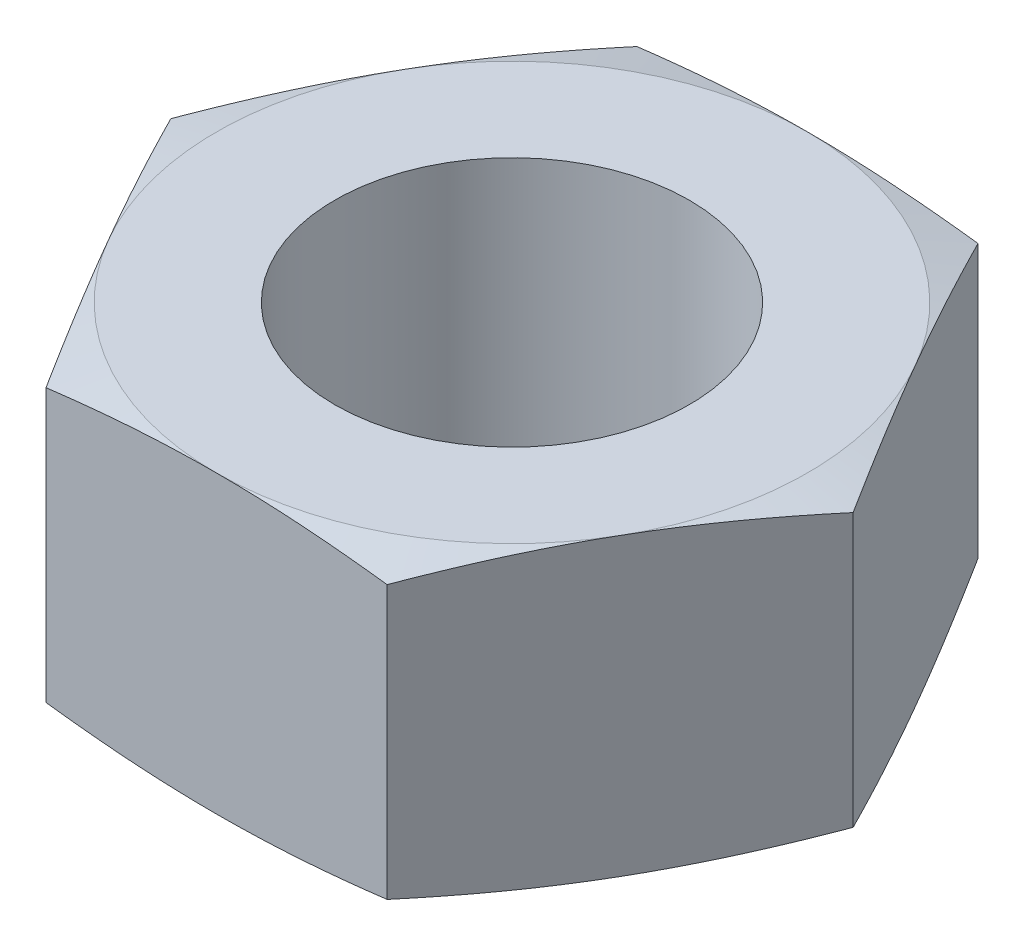
ISO-10303-21;
HEADER;
FILE_DESCRIPTION(('STEP AP214'),'2;1');
FILE_NAME('part.step','',(''),(''),'','','');
FILE_SCHEMA(('AUTOMOTIVE_DESIGN { 1 0 10303 214 1 1 1 1 }'));
ENDSEC;
DATA;
#1=APPLICATION_CONTEXT('core data for automotive mechanical design processes');
#2=APPLICATION_PROTOCOL_DEFINITION('international standard','automotive_design',2000,#1);
#3=PRODUCT_CONTEXT('',#1,'mechanical');
#4=PRODUCT('Part','Part','',(#3));
#5=PRODUCT_RELATED_PRODUCT_CATEGORY('part','',(#4));
#6=PRODUCT_DEFINITION_FORMATION('','',#4);
#7=PRODUCT_DEFINITION_CONTEXT('part definition',#1,'design');
#8=PRODUCT_DEFINITION('design','',#6,#7);
#9=PRODUCT_DEFINITION_SHAPE('','',#8);
#10=(LENGTH_UNIT() NAMED_UNIT(*) SI_UNIT(.MILLI.,.METRE.));
#11=(NAMED_UNIT(*) PLANE_ANGLE_UNIT() SI_UNIT($,.RADIAN.));
#12=(NAMED_UNIT(*) SI_UNIT($,.STERADIAN.) SOLID_ANGLE_UNIT());
#13=UNCERTAINTY_MEASURE_WITH_UNIT(LENGTH_MEASURE(1.E-05),#10,'distance_accuracy_value','');
#14=(GEOMETRIC_REPRESENTATION_CONTEXT(3) GLOBAL_UNCERTAINTY_ASSIGNED_CONTEXT((#13)) GLOBAL_UNIT_ASSIGNED_CONTEXT((#10,
#11,#12)) REPRESENTATION_CONTEXT('',''));
#15=CARTESIAN_POINT('',(0.,0.,0.));
#16=DIRECTION('',(0.,0.,1.));
#17=DIRECTION('',(1.,0.,0.));
#18=AXIS2_PLACEMENT_3D('',#15,#16,#17);
#19=CARTESIAN_POINT('',(2.88675134594813,5.,5.));
#20=DIRECTION('',(-0.866025403784439,0.,-0.5));
#21=DIRECTION('',(-0.5,0.,0.866025403784439));
#22=AXIS2_PLACEMENT_3D('',#19,#20,#21);
#23=PLANE('',#22);
#24=CARTESIAN_POINT('',(5.77361816195009,0.192884672145907,-0.000199999999995722));
#25=CARTESIAN_POINT('',(5.65367566346576,0.162966330406988,0.207546501361623));
#26=CARTESIAN_POINT('',(5.53354443530946,0.135814192823527,0.415619892103971));
#27=CARTESIAN_POINT('',(5.29291450358227,0.0881209127242306,0.8324031596773));
#28=CARTESIAN_POINT('',(5.17241568646937,0.0675820790041747,1.0411132331688));
#29=CARTESIAN_POINT('',(4.93168398048246,0.0342910124312709,1.45807277893085));
#30=CARTESIAN_POINT('',(4.81145231360634,0.0215043555509027,1.66632013463899));
#31=CARTESIAN_POINT('',(4.57085608718707,0.00435954963732404,2.08304502290651));
#32=CARTESIAN_POINT('',(4.45049155305463,0.,2.29152251145326));
#33=CARTESIAN_POINT('',(4.20976248478975,0.,2.70847748854675));
#34=CARTESIAN_POINT('',(4.08939795065731,0.00435954963732432,2.9169549770935));
#35=CARTESIAN_POINT('',(3.84880172423804,0.0215043555509033,3.33367986536102));
#36=CARTESIAN_POINT('',(3.72857005736192,0.0342910124312718,3.54192722106915));
#37=CARTESIAN_POINT('',(3.48783835137501,0.067582079004176,3.95888676683121));
#38=CARTESIAN_POINT('',(3.36733953426211,0.088120912724232,4.16759684032271));
#39=CARTESIAN_POINT('',(3.12670960253492,0.135814192823529,4.58438010789604));
#40=CARTESIAN_POINT('',(3.00657837437862,0.16296633040699,4.79245349863838));
#41=CARTESIAN_POINT('',(2.88663587589429,0.192884672145909,5.0002));
#42=B_SPLINE_CURVE_WITH_KNOTS('',3,(#24,#25,#26,#27,#28,#29,#30,#31,#32,#33,#34,#35,#36,#37,#38,
#39,#40,#41),.UNSPECIFIED.,.F.,.F.,(4,2,2,2,2,2,2,2,4),(0.,0.725263037411742,1.45077900033439,
2.1730492057684,2.89519935795036,3.61734951013232,4.33961971556633,5.06513567848897,
5.79039871590072),.UNSPECIFIED.);
#43=CARTESIAN_POINT('',(5.77350269189625,0.192855881364315,0.));
#44=VERTEX_POINT('',#43);
#45=CARTESIAN_POINT('',(4.3301270189222,0.,2.5));
#46=VERTEX_POINT('',#45);
#47=EDGE_CURVE('E51',#44,#46,#42,.T.);
#48=ORIENTED_EDGE('',*,*,#47,.F.);
#49=DIRECTION('',(0.,-1.,0.));
#50=VECTOR('',#49,1.);
#51=CARTESIAN_POINT('',(5.77350269189625,5.,0.));
#52=LINE('',#51,#50);
#53=CARTESIAN_POINT('',(5.77350269189625,4.80714411863568,0.));
#54=VERTEX_POINT('',#53);
#55=EDGE_CURVE('E167',#54,#44,#52,.T.);
#56=ORIENTED_EDGE('',*,*,#55,.F.);
#57=CARTESIAN_POINT('',(2.88663587589429,4.80711532785409,5.0002));
#58=CARTESIAN_POINT('',(3.00657837437862,4.83703366959301,4.79245349863838));
#59=CARTESIAN_POINT('',(3.12670960253491,4.86418580717647,4.58438010789604));
#60=CARTESIAN_POINT('',(3.36733953426211,4.91187908727577,4.16759684032271));
#61=CARTESIAN_POINT('',(3.48783835137501,4.93241792099582,3.95888676683121));
#62=CARTESIAN_POINT('',(3.72857005736192,4.96570898756873,3.54192722106915));
#63=CARTESIAN_POINT('',(3.84880172423804,4.9784956444491,3.33367986536102));
#64=CARTESIAN_POINT('',(4.08939795065731,4.99564045036268,2.9169549770935));
#65=CARTESIAN_POINT('',(4.20976248478975,5.,2.70847748854675));
#66=CARTESIAN_POINT('',(4.45049155305463,5.,2.29152251145326));
#67=CARTESIAN_POINT('',(4.57085608718707,4.99564045036268,2.08304502290651));
#68=CARTESIAN_POINT('',(4.81145231360634,4.9784956444491,1.66632013463899));
#69=CARTESIAN_POINT('',(4.93168398048246,4.96570898756873,1.45807277893085));
#70=CARTESIAN_POINT('',(5.17241568646937,4.93241792099583,1.0411132331688));
#71=CARTESIAN_POINT('',(5.29291450358227,4.91187908727577,0.8324031596773));
#72=CARTESIAN_POINT('',(5.53354443530946,4.86418580717647,0.415619892103971));
#73=CARTESIAN_POINT('',(5.65367566346576,4.83703366959301,0.207546501361623));
#74=CARTESIAN_POINT('',(5.77361816195009,4.80711532785409,-0.000199999999994956));
#75=B_SPLINE_CURVE_WITH_KNOTS('',3,(#57,#58,#59,#60,#61,#62,#63,#64,#65,#66,#67,#68,#69,#70,#71,
#72,#73,#74),.UNSPECIFIED.,.F.,.F.,(4,2,2,2,2,2,2,2,4),(0.,0.725263037411742,1.45077900033439,
2.1730492057684,2.89519935795036,3.61734951013232,4.33961971556633,5.06513567848898,
5.79039871590072),.UNSPECIFIED.);
#76=CARTESIAN_POINT('',(4.33012701892219,5.,2.5));
#77=VERTEX_POINT('',#76);
#78=EDGE_CURVE('E221',#77,#54,#75,.T.);
#79=ORIENTED_EDGE('',*,*,#78,.F.);
#80=CARTESIAN_POINT('',(2.88675134594813,4.80714411863568,5.));
#81=VERTEX_POINT('',#80);
#82=EDGE_CURVE('E319',#81,#77,#75,.T.);
#83=ORIENTED_EDGE('',*,*,#82,.F.);
#84=DIRECTION('',(0.,-1.,0.));
#85=VECTOR('',#84,1.);
#86=CARTESIAN_POINT('',(2.88675134594813,5.,5.));
#87=LINE('',#86,#85);
#88=CARTESIAN_POINT('',(2.88675134594813,0.192855881364317,5.));
#89=VERTEX_POINT('',#88);
#90=EDGE_CURVE('E153',#81,#89,#87,.T.);
#91=ORIENTED_EDGE('',*,*,#90,.T.);
#92=EDGE_CURVE('E146',#46,#89,#42,.T.);
#93=ORIENTED_EDGE('',*,*,#92,.F.);
#94=EDGE_LOOP('',(#48,#56,#79,#83,#91,#93));
#95=FACE_BOUND('',#94,.T.);
#96=ADVANCED_FACE('F35',(#95),#23,.F.);
#97=CARTESIAN_POINT('',(5.77350269189625,5.,0.));
#98=DIRECTION('',(-0.866025403784439,0.,0.5));
#99=DIRECTION('',(0.5,0.,0.866025403784439));
#100=AXIS2_PLACEMENT_3D('',#97,#98,#99);
#101=PLANE('',#100);
#102=CARTESIAN_POINT('',(2.88663587589428,0.192884672145907,-5.0002));
#103=CARTESIAN_POINT('',(3.00657837437862,0.162966330406988,-4.79245349863838));
#104=CARTESIAN_POINT('',(3.12670960253491,0.135814192823527,-4.58438010789603));
#105=CARTESIAN_POINT('',(3.3673395342621,0.0881209127242301,-4.1675968403227));
#106=CARTESIAN_POINT('',(3.48783835137501,0.067582079004174,-3.9588867668312));
#107=CARTESIAN_POINT('',(3.72857005736191,0.0342910124312699,-3.54192722106915));
#108=CARTESIAN_POINT('',(3.84880172423803,0.0215043555509016,-3.33367986536101));
#109=CARTESIAN_POINT('',(4.0893979506573,0.00435954963732282,-2.91695497709349));
#110=CARTESIAN_POINT('',(4.20976248478975,0.,-2.70847748854674));
#111=CARTESIAN_POINT('',(4.45049155305463,0.,-2.29152251145325));
#112=CARTESIAN_POINT('',(4.57085608718707,0.0043595496373228,-2.08304502290651));
#113=CARTESIAN_POINT('',(4.81145231360634,0.0215043555509016,-1.66632013463898));
#114=CARTESIAN_POINT('',(4.93168398048246,0.0342910124312699,-1.45807277893085));
#115=CARTESIAN_POINT('',(5.17241568646937,0.067582079004174,-1.04111323316879));
#116=CARTESIAN_POINT('',(5.29291450358227,0.0881209127242301,-0.832403159677293));
#117=CARTESIAN_POINT('',(5.53354443530946,0.135814192823527,-0.415619892103963));
#118=CARTESIAN_POINT('',(5.65367566346576,0.162966330406988,-0.207546501361615));
#119=CARTESIAN_POINT('',(5.77361816195009,0.192884672145907,0.000200000000003531));
#120=B_SPLINE_CURVE_WITH_KNOTS('',3,(#102,#103,#104,#105,#106,#107,#108,#109,#110,#111,#112,
#113,#114,#115,#116,#117,#118,#119),.UNSPECIFIED.,.F.,.F.,(4,2,2,2,2,2,2,2,4),(0.,
0.725263037411743,1.45077900033439,2.1730492057684,2.89519935795036,3.61734951013232,
4.33961971556633,5.06513567848898,5.79039871590072),.UNSPECIFIED.);
#121=CARTESIAN_POINT('',(2.88675134594812,0.192855881364315,-5.));
#122=VERTEX_POINT('',#121);
#123=CARTESIAN_POINT('',(4.33012701892219,0.,-2.5));
#124=VERTEX_POINT('',#123);
#125=EDGE_CURVE('E58',#122,#124,#120,.T.);
#126=ORIENTED_EDGE('',*,*,#125,.F.);
#127=DIRECTION('',(0.,-1.,0.));
#128=VECTOR('',#127,1.);
#129=CARTESIAN_POINT('',(2.88675134594812,5.,-5.));
#130=LINE('',#129,#128);
#131=CARTESIAN_POINT('',(2.88675134594812,4.80714411863568,-5.));
#132=VERTEX_POINT('',#131);
#133=EDGE_CURVE('E164',#132,#122,#130,.T.);
#134=ORIENTED_EDGE('',*,*,#133,.F.);
#135=CARTESIAN_POINT('',(5.77361816195009,4.80711532785409,0.000200000000004353));
#136=CARTESIAN_POINT('',(5.65367566346576,4.83703366959301,-0.207546501361615));
#137=CARTESIAN_POINT('',(5.53354443530946,4.86418580717647,-0.415619892103962));
#138=CARTESIAN_POINT('',(5.29291450358227,4.91187908727577,-0.832403159677292));
#139=CARTESIAN_POINT('',(5.17241568646937,4.93241792099583,-1.04111323316879));
#140=CARTESIAN_POINT('',(4.93168398048246,4.96570898756873,-1.45807277893085));
#141=CARTESIAN_POINT('',(4.81145231360634,4.9784956444491,-1.66632013463898));
#142=CARTESIAN_POINT('',(4.57085608718707,4.99564045036268,-2.0830450229065));
#143=CARTESIAN_POINT('',(4.45049155305463,5.,-2.29152251145325));
#144=CARTESIAN_POINT('',(4.20976248478975,5.,-2.70847748854674));
#145=CARTESIAN_POINT('',(4.0893979506573,4.99564045036268,-2.91695497709349));
#146=CARTESIAN_POINT('',(3.84880172423803,4.9784956444491,-3.33367986536101));
#147=CARTESIAN_POINT('',(3.72857005736191,4.96570898756873,-3.54192722106915));
#148=CARTESIAN_POINT('',(3.48783835137501,4.93241792099583,-3.9588867668312));
#149=CARTESIAN_POINT('',(3.3673395342621,4.91187908727577,-4.1675968403227));
#150=CARTESIAN_POINT('',(3.12670960253491,4.86418580717647,-4.58438010789603));
#151=CARTESIAN_POINT('',(3.00657837437862,4.83703366959301,-4.79245349863838));
#152=CARTESIAN_POINT('',(2.88663587589428,4.80711532785409,-5.0002));
#153=B_SPLINE_CURVE_WITH_KNOTS('',3,(#135,#136,#137,#138,#139,#140,#141,#142,#143,#144,#145,
#146,#147,#148,#149,#150,#151,#152),.UNSPECIFIED.,.F.,.F.,(4,2,2,2,2,2,2,2,4),(0.,
0.725263037411743,1.45077900033439,2.1730492057684,2.89519935795036,3.61734951013233,
4.33961971556633,5.06513567848898,5.79039871590072),.UNSPECIFIED.);
#154=CARTESIAN_POINT('',(4.33012701892219,5.,-2.5));
#155=VERTEX_POINT('',#154);
#156=EDGE_CURVE('E215',#155,#132,#153,.T.);
#157=ORIENTED_EDGE('',*,*,#156,.F.);
#158=EDGE_CURVE('E219',#54,#155,#153,.T.);
#159=ORIENTED_EDGE('',*,*,#158,.F.);
#160=ORIENTED_EDGE('',*,*,#55,.T.);
#161=EDGE_CURVE('E234',#124,#44,#120,.T.);
#162=ORIENTED_EDGE('',*,*,#161,.F.);
#163=EDGE_LOOP('',(#126,#134,#157,#159,#160,#162));
#164=FACE_BOUND('',#163,.T.);
#165=ADVANCED_FACE('F226',(#164),#101,.F.);
#166=CARTESIAN_POINT('',(2.88675134594812,5.,-5.));
#167=DIRECTION('',(0.,0.,1.));
#168=DIRECTION('',(1.,0.,0.));
#169=AXIS2_PLACEMENT_3D('',#166,#167,#168);
#170=PLANE('',#169);
#171=CARTESIAN_POINT('',(-7.6305218451275,1.02792106951907,-5.));
#172=CARTESIAN_POINT('',(-7.40369596858197,0.980630391697127,-5.));
#173=CARTESIAN_POINT('',(-7.17674631792952,0.933923199202165,-5.));
#174=CARTESIAN_POINT('',(-6.72253882576785,0.841989190230502,-5.));
#175=CARTESIAN_POINT('',(-6.49528097296649,0.796762429609511,-5.));
#176=CARTESIAN_POINT('',(-6.04021985114472,0.708068554088652,-5.));
#177=CARTESIAN_POINT('',(-5.81241628246833,0.66460297041051,-5.));
#178=CARTESIAN_POINT('',(-5.35639701616018,0.579895455230126,-5.));
#179=CARTESIAN_POINT('',(-5.12818132158576,0.538653507301369,-5.));
#180=CARTESIAN_POINT('',(-4.67283413751471,0.459191873470008,-5.));
#181=CARTESIAN_POINT('',(-4.44570596421195,0.420953378771854,-5.));
#182=CARTESIAN_POINT('',(-3.99091085303777,0.347835521530994,-5.));
#183=CARTESIAN_POINT('',(-3.76324390445121,0.312956226381003,-5.));
#184=CARTESIAN_POINT('',(-3.07937962246211,0.214509697113264,-5.));
#185=CARTESIAN_POINT('',(-2.6222327521849,0.157118226750703,-5.));
#186=CARTESIAN_POINT('',(-1.93248668202519,0.0888272191369867,-5.));
#187=CARTESIAN_POINT('',(-1.70077069534079,0.0689775119585176,-5.));
#188=CARTESIAN_POINT('',(-1.23683260927792,0.036375613089383,-5.));
#189=CARTESIAN_POINT('',(-1.0046105197085,0.0236232850475451,-5.));
#190=CARTESIAN_POINT('',(-0.5399532660013,0.00594222678315789,-5.));
#191=CARTESIAN_POINT('',(-0.307518218675345,0.00101047925139975,-5.));
#192=CARTESIAN_POINT('',(0.157382933946641,-0.000729494899017344,-5.));
#193=CARTESIAN_POINT('',(0.389849039217068,0.00246227182632879,-5.));
#194=CARTESIAN_POINT('',(0.855262774585651,0.0167900915629019,-5.));
#195=CARTESIAN_POINT('',(1.08820962128495,0.0279510853880331,-5.));
#196=CARTESIAN_POINT('',(1.5536330729725,0.0575887145548008,-5.));
#197=CARTESIAN_POINT('',(1.7861096692289,0.076065484508654,-5.));
#198=CARTESIAN_POINT('',(2.25058697366131,0.119410717922282,-5.));
#199=CARTESIAN_POINT('',(2.48258734776666,0.144282708696195,-5.));
#200=CARTESIAN_POINT('',(2.94594079229084,0.199401212899263,-5.));
#201=CARTESIAN_POINT('',(3.17729386083051,0.229647741914404,-5.));
#202=CARTESIAN_POINT('',(3.84072667935434,0.32279955205869,-5.));
#203=CARTESIAN_POINT('',(4.27203190491143,0.391195085335354,-5.));
#204=CARTESIAN_POINT('',(5.1328886807327,0.538250192622818,-5.));
#205=CARTESIAN_POINT('',(5.56244002934685,0.616910914396046,-5.));
#206=CARTESIAN_POINT('',(6.42031400903308,0.781134662562965,-5.));
#207=CARTESIAN_POINT('',(6.84863633330645,0.866699279401662,-5.));
#208=CARTESIAN_POINT('',(7.7042840186875,1.0425312050005,-5.));
#209=CARTESIAN_POINT('',(8.13160942985231,1.13279827208894,-5.));
#210=CARTESIAN_POINT('',(8.98191543182807,1.31585636607849,-5.));
#211=CARTESIAN_POINT('',(9.40490207057782,1.40861940533503,-5.));
#212=CARTESIAN_POINT('',(10.2503578957856,1.59649955627264,-5.));
#213=CARTESIAN_POINT('',(10.6728270738327,1.69161670569893,-5.));
#214=CARTESIAN_POINT('',(11.5169016313527,1.88348287421526,-5.));
#215=CARTESIAN_POINT('',(11.9385074492698,1.98022996855996,-5.));
#216=CARTESIAN_POINT('',(12.7813971606523,2.17506177463464,-5.));
#217=CARTESIAN_POINT('',(13.2026810631537,2.273146447245,-5.));
#218=CARTESIAN_POINT('',(13.623852884615,2.3717043755312,-5.));
#219=B_SPLINE_CURVE_WITH_KNOTS('',3,(#171,#172,#173,#174,#175,#176,#177,#178,#179,#180,#181,
#182,#183,#184,#185,#186,#187,#188,#189,#190,#191,#192,#193,#194,#195,#196,#197,#198,#199,#200,
#201,#202,#203,#204,#205,#206,#207,#208,#209,#210,#211,#212,#213,#214,#215,#216,#217,#218),
.UNSPECIFIED.,.F.,.F.,(4,2,2,2,2,2,2,2,2,2,2,2,2,2,2,2,2,2,2,2,2,2,2,4),(0.,0.695111991871213,
1.39025017969673,2.08598031236921,2.78170530481713,3.47265283456902,4.16361422331709,
5.54527459345935,6.24288042112804,6.94047284629219,7.63779606323015,8.33511870881707,
9.03463334323472,9.73416084950494,10.4340750142032,11.1339912086626,12.4438578844103,
13.7538711435296,15.0641870557896,16.3744356936585,17.6735432827575,18.9726717149382,
20.2703608102221,21.5680120335567),.UNSPECIFIED.);
#220=CARTESIAN_POINT('',(-2.88675134594813,0.192855881364317,-5.));
#221=VERTEX_POINT('',#220);
#222=CARTESIAN_POINT('',(0.,0.,-5.));
#223=VERTEX_POINT('',#222);
#224=EDGE_CURVE('E249',#221,#223,#219,.T.);
#225=ORIENTED_EDGE('',*,*,#224,.F.);
#226=DIRECTION('',(0.,-1.,0.));
#227=VECTOR('',#226,1.);
#228=CARTESIAN_POINT('',(-2.88675134594813,5.,-5.));
#229=LINE('',#228,#227);
#230=CARTESIAN_POINT('',(-2.88675134594813,4.80714411863568,-5.));
#231=VERTEX_POINT('',#230);
#232=EDGE_CURVE('E155',#231,#221,#229,.T.);
#233=ORIENTED_EDGE('',*,*,#232,.F.);
#234=CARTESIAN_POINT('',(-7.6305218451275,3.97207893048093,-5.));
#235=CARTESIAN_POINT('',(-7.40369596858198,4.01936960830287,-5.));
#236=CARTESIAN_POINT('',(-7.17674631792953,4.06607680079783,-5.));
#237=CARTESIAN_POINT('',(-6.72253882576786,4.1580108097695,-5.));
#238=CARTESIAN_POINT('',(-6.49528097296649,4.20323757039049,-5.));
#239=CARTESIAN_POINT('',(-6.04021985114473,4.29193144591135,-5.));
#240=CARTESIAN_POINT('',(-5.81241628246834,4.33539702958949,-5.));
#241=CARTESIAN_POINT('',(-5.35639701616018,4.42010454476987,-5.));
#242=CARTESIAN_POINT('',(-5.12818132158576,4.46134649269863,-5.));
#243=CARTESIAN_POINT('',(-4.67283413751471,4.54080812652999,-5.));
#244=CARTESIAN_POINT('',(-4.44570596421196,4.57904662122815,-5.));
#245=CARTESIAN_POINT('',(-3.99091085303778,4.652164478469,-5.));
#246=CARTESIAN_POINT('',(-3.76324390445121,4.687043773619,-5.));
#247=CARTESIAN_POINT('',(-3.07937962246211,4.78549030288674,-5.));
#248=CARTESIAN_POINT('',(-2.6222327521849,4.8428817732493,-5.));
#249=CARTESIAN_POINT('',(-1.93248668202519,4.91117278086301,-5.));
#250=CARTESIAN_POINT('',(-1.70077069534079,4.93102248804148,-5.));
#251=CARTESIAN_POINT('',(-1.23683260927792,4.96362438691062,-5.));
#252=CARTESIAN_POINT('',(-1.0046105197085,4.97637671495245,-5.));
#253=CARTESIAN_POINT('',(-0.539953266001301,4.99405777321684,-5.));
#254=CARTESIAN_POINT('',(-0.307518218675345,4.9989895207486,-5.));
#255=CARTESIAN_POINT('',(0.157382933946642,5.00072949489902,-5.));
#256=CARTESIAN_POINT('',(0.389849039217068,4.99753772817367,-5.));
#257=CARTESIAN_POINT('',(0.855262774585651,4.9832099084371,-5.));
#258=CARTESIAN_POINT('',(1.08820962128495,4.97204891461197,-5.));
#259=CARTESIAN_POINT('',(1.5536330729725,4.9424112854452,-5.));
#260=CARTESIAN_POINT('',(1.7861096692289,4.92393451549135,-5.));
#261=CARTESIAN_POINT('',(2.25058697366131,4.88058928207772,-5.));
#262=CARTESIAN_POINT('',(2.48258734776667,4.8557172913038,-5.));
#263=CARTESIAN_POINT('',(2.94594079229084,4.80059878710074,-5.));
#264=CARTESIAN_POINT('',(3.17729386083052,4.7703522580856,-5.));
#265=CARTESIAN_POINT('',(3.84072667935434,4.67720044794131,-5.));
#266=CARTESIAN_POINT('',(4.27203190491143,4.60880491466465,-5.));
#267=CARTESIAN_POINT('',(5.1328886807327,4.46174980737718,-5.));
#268=CARTESIAN_POINT('',(5.56244002934685,4.38308908560395,-5.));
#269=CARTESIAN_POINT('',(6.42031400903308,4.21886533743703,-5.));
#270=CARTESIAN_POINT('',(6.84863633330645,4.13330072059834,-5.));
#271=CARTESIAN_POINT('',(7.7042840186875,3.9574687949995,-5.));
#272=CARTESIAN_POINT('',(8.13160942985231,3.86720172791106,-5.));
#273=CARTESIAN_POINT('',(8.98191543182807,3.68414363392151,-5.));
#274=CARTESIAN_POINT('',(9.40490207057783,3.59138059466497,-5.));
#275=CARTESIAN_POINT('',(10.2503578957856,3.40350044372736,-5.));
#276=CARTESIAN_POINT('',(10.6728270738327,3.30838329430107,-5.));
#277=CARTESIAN_POINT('',(11.5169016313527,3.11651712578474,-5.));
#278=CARTESIAN_POINT('',(11.9385074492698,3.01977003144004,-5.));
#279=CARTESIAN_POINT('',(12.7813971606523,2.82493822536536,-5.));
#280=CARTESIAN_POINT('',(13.2026810631537,2.726853552755,-5.));
#281=CARTESIAN_POINT('',(13.623852884615,2.6282956244688,-5.));
#282=B_SPLINE_CURVE_WITH_KNOTS('',3,(#234,#235,#236,#237,#238,#239,#240,#241,#242,#243,#244,
#245,#246,#247,#248,#249,#250,#251,#252,#253,#254,#255,#256,#257,#258,#259,#260,#261,#262,#263,
#264,#265,#266,#267,#268,#269,#270,#271,#272,#273,#274,#275,#276,#277,#278,#279,#280,#281),
.UNSPECIFIED.,.F.,.F.,(4,2,2,2,2,2,2,2,2,2,2,2,2,2,2,2,2,2,2,2,2,2,2,4),(0.,0.695111991871213,
1.39025017969673,2.0859803123692,2.78170530481713,3.47265283456902,4.16361422331709,
5.54527459345935,6.24288042112804,6.94047284629219,7.63779606323015,8.33511870881707,
9.03463334323472,9.73416084950494,10.4340750142032,11.1339912086626,12.4438578844104,
13.7538711435296,15.0641870557896,16.3744356936585,17.6735432827576,18.9726717149382,
20.2703608102221,21.5680120335567),.UNSPECIFIED.);
#283=CARTESIAN_POINT('',(0.,5.,-5.));
#284=VERTEX_POINT('',#283);
#285=EDGE_CURVE('E209',#284,#231,#282,.F.);
#286=ORIENTED_EDGE('',*,*,#285,.F.);
#287=EDGE_CURVE('E220',#132,#284,#282,.F.);
#288=ORIENTED_EDGE('',*,*,#287,.F.);
#289=ORIENTED_EDGE('',*,*,#133,.T.);
#290=EDGE_CURVE('E245',#223,#122,#219,.T.);
#291=ORIENTED_EDGE('',*,*,#290,.F.);
#292=EDGE_LOOP('',(#225,#233,#286,#288,#289,#291));
#293=FACE_BOUND('',#292,.T.);
#294=ADVANCED_FACE('F229',(#293),#170,.F.);
#295=CARTESIAN_POINT('',(-2.88675134594813,5.,-5.));
#296=DIRECTION('',(0.866025403784439,0.,0.5));
#297=DIRECTION('',(0.5,0.,-0.866025403784439));
#298=AXIS2_PLACEMENT_3D('',#295,#296,#297);
#299=PLANE('',#298);
#300=CARTESIAN_POINT('',(-5.7736181619501,0.192884672145909,0.000200000000002456));
#301=CARTESIAN_POINT('',(-5.65367566346576,0.16296633040699,-0.207546501361616));
#302=CARTESIAN_POINT('',(-5.53354443530947,0.135814192823529,-0.415619892103964));
#303=CARTESIAN_POINT('',(-5.29291450358228,0.0881209127242324,-0.832403159677294));
#304=CARTESIAN_POINT('',(-5.17241568646938,0.0675820790041763,-1.04111323316879));
#305=CARTESIAN_POINT('',(-4.93168398048247,0.0342910124312723,-1.45807277893085));
#306=CARTESIAN_POINT('',(-4.81145231360635,0.021504355550904,-1.66632013463898));
#307=CARTESIAN_POINT('',(-4.57085608718708,0.00435954963732504,-2.0830450229065));
#308=CARTESIAN_POINT('',(-4.45049155305464,0.,-2.29152251145325));
#309=CARTESIAN_POINT('',(-4.20976248478976,0.,-2.70847748854674));
#310=CARTESIAN_POINT('',(-4.08939795065731,0.00435954963732486,-2.91695497709349));
#311=CARTESIAN_POINT('',(-3.84880172423804,0.0215043555509036,-3.33367986536101));
#312=CARTESIAN_POINT('',(-3.72857005736192,0.0342910124312718,-3.54192722106915));
#313=CARTESIAN_POINT('',(-3.48783835137502,0.0675820790041757,-3.9588867668312));
#314=CARTESIAN_POINT('',(-3.36733953426211,0.0881209127242317,-4.1675968403227));
#315=CARTESIAN_POINT('',(-3.12670960253492,0.135814192823528,-4.58438010789603));
#316=CARTESIAN_POINT('',(-3.00657837437863,0.162966330406989,-4.79245349863838));
#317=CARTESIAN_POINT('',(-2.88663587589429,0.192884672145909,-5.0002));
#318=B_SPLINE_CURVE_WITH_KNOTS('',3,(#300,#301,#302,#303,#304,#305,#306,#307,#308,#309,#310,
#311,#312,#313,#314,#315,#316,#317),.UNSPECIFIED.,.F.,.F.,(4,2,2,2,2,2,2,2,4),(0.,
0.725263037411742,1.45077900033439,2.1730492057684,2.89519935795036,3.61734951013232,
4.33961971556633,5.06513567848898,5.79039871590072),.UNSPECIFIED.);
#319=CARTESIAN_POINT('',(-5.77350269189626,0.192855881364317,0.));
#320=VERTEX_POINT('',#319);
#321=CARTESIAN_POINT('',(-4.33012701892219,0.,-2.5));
#322=VERTEX_POINT('',#321);
#323=EDGE_CURVE('E240',#320,#322,#318,.T.);
#324=ORIENTED_EDGE('',*,*,#323,.F.);
#325=DIRECTION('',(0.,-1.,0.));
#326=VECTOR('',#325,1.);
#327=CARTESIAN_POINT('',(-5.77350269189626,5.,0.));
#328=LINE('',#327,#326);
#329=CARTESIAN_POINT('',(-5.77350269189626,4.80714411863568,0.));
#330=VERTEX_POINT('',#329);
#331=EDGE_CURVE('E152',#330,#320,#328,.T.);
#332=ORIENTED_EDGE('',*,*,#331,.F.);
#333=CARTESIAN_POINT('',(-2.88663587589429,4.80711532785409,-5.0002));
#334=CARTESIAN_POINT('',(-3.00657837437863,4.83703366959301,-4.79245349863838));
#335=CARTESIAN_POINT('',(-3.12670960253492,4.86418580717647,-4.58438010789603));
#336=CARTESIAN_POINT('',(-3.36733953426211,4.91187908727577,-4.1675968403227));
#337=CARTESIAN_POINT('',(-3.48783835137502,4.93241792099582,-3.95888676683121));
#338=CARTESIAN_POINT('',(-3.72857005736192,4.96570898756873,-3.54192722106915));
#339=CARTESIAN_POINT('',(-3.84880172423804,4.9784956444491,-3.33367986536101));
#340=CARTESIAN_POINT('',(-4.08939795065731,4.99564045036268,-2.91695497709349));
#341=CARTESIAN_POINT('',(-4.20976248478975,5.,-2.70847748854675));
#342=CARTESIAN_POINT('',(-4.45049155305464,5.,-2.29152251145325));
#343=CARTESIAN_POINT('',(-4.57085608718708,4.99564045036268,-2.08304502290651));
#344=CARTESIAN_POINT('',(-4.81145231360635,4.9784956444491,-1.66632013463898));
#345=CARTESIAN_POINT('',(-4.93168398048247,4.96570898756873,-1.45807277893085));
#346=CARTESIAN_POINT('',(-5.17241568646938,4.93241792099582,-1.04111323316879));
#347=CARTESIAN_POINT('',(-5.29291450358228,4.91187908727577,-0.832403159677295));
#348=CARTESIAN_POINT('',(-5.53354443530947,4.86418580717647,-0.415619892103964));
#349=CARTESIAN_POINT('',(-5.65367566346576,4.83703366959301,-0.207546501361617));
#350=CARTESIAN_POINT('',(-5.7736181619501,4.80711532785409,0.000200000000001383));
#351=B_SPLINE_CURVE_WITH_KNOTS('',3,(#333,#334,#335,#336,#337,#338,#339,#340,#341,#342,#343,
#344,#345,#346,#347,#348,#349,#350),.UNSPECIFIED.,.F.,.F.,(4,2,2,2,2,2,2,2,4),(0.,
0.725263037411742,1.45077900033439,2.1730492057684,2.89519935795036,3.61734951013232,
4.33961971556633,5.06513567848898,5.79039871590072),.UNSPECIFIED.);
#352=CARTESIAN_POINT('',(-4.3301270189222,5.,-2.5));
#353=VERTEX_POINT('',#352);
#354=EDGE_CURVE('E203',#353,#330,#351,.T.);
#355=ORIENTED_EDGE('',*,*,#354,.F.);
#356=EDGE_CURVE('E439',#231,#353,#351,.T.);
#357=ORIENTED_EDGE('',*,*,#356,.F.);
#358=ORIENTED_EDGE('',*,*,#232,.T.);
#359=EDGE_CURVE('E250',#322,#221,#318,.T.);
#360=ORIENTED_EDGE('',*,*,#359,.F.);
#361=EDGE_LOOP('',(#324,#332,#355,#357,#358,#360));
#362=FACE_BOUND('',#361,.T.);
#363=ADVANCED_FACE('F301',(#362),#299,.F.);
#364=CARTESIAN_POINT('',(-5.77350269189626,5.,0.));
#365=DIRECTION('',(0.866025403784439,0.,-0.5));
#366=DIRECTION('',(-0.5,0.,-0.866025403784439));
#367=AXIS2_PLACEMENT_3D('',#364,#365,#366);
#368=PLANE('',#367);
#369=CARTESIAN_POINT('',(-2.88663587589429,0.192884672145909,5.0002));
#370=CARTESIAN_POINT('',(-3.00657837437863,0.16296633040699,4.79245349863838));
#371=CARTESIAN_POINT('',(-3.12670960253492,0.135814192823529,4.58438010789604));
#372=CARTESIAN_POINT('',(-3.36733953426211,0.0881209127242326,4.16759684032271));
#373=CARTESIAN_POINT('',(-3.48783835137502,0.0675820790041766,3.95888676683121));
#374=CARTESIAN_POINT('',(-3.72857005736192,0.0342910124312726,3.54192722106915));
#375=CARTESIAN_POINT('',(-3.84880172423804,0.0215043555509043,3.33367986536102));
#376=CARTESIAN_POINT('',(-4.08939795065731,0.00435954963732554,2.9169549770935));
#377=CARTESIAN_POINT('',(-4.20976248478976,0.,2.70847748854675));
#378=CARTESIAN_POINT('',(-4.45049155305464,0.,2.29152251145326));
#379=CARTESIAN_POINT('',(-4.57085608718708,0.00435954963732547,2.08304502290651));
#380=CARTESIAN_POINT('',(-4.81145231360635,0.0215043555509042,1.66632013463899));
#381=CARTESIAN_POINT('',(-4.93168398048247,0.0342910124312724,1.45807277893085));
#382=CARTESIAN_POINT('',(-5.17241568646938,0.0675820790041764,1.0411132331688));
#383=CARTESIAN_POINT('',(-5.29291450358228,0.0881209127242325,0.832403159677299));
#384=CARTESIAN_POINT('',(-5.53354443530947,0.135814192823529,0.415619892103969));
#385=CARTESIAN_POINT('',(-5.65367566346577,0.16296633040699,0.207546501361622));
#386=CARTESIAN_POINT('',(-5.7736181619501,0.192884672145909,-0.000199999999997101));
#387=B_SPLINE_CURVE_WITH_KNOTS('',3,(#369,#370,#371,#372,#373,#374,#375,#376,#377,#378,#379,
#380,#381,#382,#383,#384,#385,#386),.UNSPECIFIED.,.F.,.F.,(4,2,2,2,2,2,2,2,4),(0.,
0.725263037411742,1.45077900033439,2.1730492057684,2.89519935795036,3.61734951013232,
4.33961971556633,5.06513567848898,5.79039871590072),.UNSPECIFIED.);
#388=CARTESIAN_POINT('',(-2.88675134594813,0.192855881364317,5.));
#389=VERTEX_POINT('',#388);
#390=CARTESIAN_POINT('',(-4.33012701892219,0.,2.5));
#391=VERTEX_POINT('',#390);
#392=EDGE_CURVE('E129',#389,#391,#387,.T.);
#393=ORIENTED_EDGE('',*,*,#392,.F.);
#394=DIRECTION('',(0.,-1.,0.));
#395=VECTOR('',#394,1.);
#396=CARTESIAN_POINT('',(-2.88675134594813,5.,5.));
#397=LINE('',#396,#395);
#398=CARTESIAN_POINT('',(-2.88675134594813,4.80714411863568,5.));
#399=VERTEX_POINT('',#398);
#400=EDGE_CURVE('E143',#399,#389,#397,.T.);
#401=ORIENTED_EDGE('',*,*,#400,.F.);
#402=CARTESIAN_POINT('',(-5.7736181619501,4.80711532785409,-0.000199999999997592));
#403=CARTESIAN_POINT('',(-5.65367566346577,4.83703366959301,0.207546501361621));
#404=CARTESIAN_POINT('',(-5.53354443530947,4.86418580717647,0.415619892103969));
#405=CARTESIAN_POINT('',(-5.29291450358228,4.91187908727577,0.832403159677298));
#406=CARTESIAN_POINT('',(-5.17241568646938,4.93241792099582,1.0411132331688));
#407=CARTESIAN_POINT('',(-4.93168398048247,4.96570898756873,1.45807277893085));
#408=CARTESIAN_POINT('',(-4.81145231360635,4.9784956444491,1.66632013463899));
#409=CARTESIAN_POINT('',(-4.57085608718708,4.99564045036268,2.08304502290651));
#410=CARTESIAN_POINT('',(-4.45049155305464,5.,2.29152251145326));
#411=CARTESIAN_POINT('',(-4.20976248478976,5.,2.70847748854675));
#412=CARTESIAN_POINT('',(-4.08939795065731,4.99564045036267,2.9169549770935));
#413=CARTESIAN_POINT('',(-3.84880172423804,4.9784956444491,3.33367986536102));
#414=CARTESIAN_POINT('',(-3.72857005736192,4.96570898756873,3.54192722106915));
#415=CARTESIAN_POINT('',(-3.48783835137502,4.93241792099582,3.95888676683121));
#416=CARTESIAN_POINT('',(-3.36733953426211,4.91187908727577,4.16759684032271));
#417=CARTESIAN_POINT('',(-3.12670960253492,4.86418580717647,4.58438010789604));
#418=CARTESIAN_POINT('',(-3.00657837437863,4.83703366959301,4.79245349863838));
#419=CARTESIAN_POINT('',(-2.88663587589429,4.80711532785409,5.0002));
#420=B_SPLINE_CURVE_WITH_KNOTS('',3,(#402,#403,#404,#405,#406,#407,#408,#409,#410,#411,#412,
#413,#414,#415,#416,#417,#418,#419),.UNSPECIFIED.,.F.,.F.,(4,2,2,2,2,2,2,2,4),(0.,
0.725263037411742,1.45077900033439,2.1730492057684,2.89519935795036,3.61734951013232,
4.33961971556633,5.06513567848898,5.79039871590072),.UNSPECIFIED.);
#421=CARTESIAN_POINT('',(-4.3301270189222,5.,2.5));
#422=VERTEX_POINT('',#421);
#423=EDGE_CURVE('E196',#422,#399,#420,.T.);
#424=ORIENTED_EDGE('',*,*,#423,.F.);
#425=EDGE_CURVE('E259',#330,#422,#420,.T.);
#426=ORIENTED_EDGE('',*,*,#425,.F.);
#427=ORIENTED_EDGE('',*,*,#331,.T.);
#428=EDGE_CURVE('E145',#391,#320,#387,.T.);
#429=ORIENTED_EDGE('',*,*,#428,.F.);
#430=EDGE_LOOP('',(#393,#401,#424,#426,#427,#429));
#431=FACE_BOUND('',#430,.T.);
#432=ADVANCED_FACE('F141',(#431),#368,.F.);
#433=CARTESIAN_POINT('',(-2.88675134594813,5.,5.));
#434=DIRECTION('',(0.,0.,-1.));
#435=DIRECTION('',(-1.,0.,0.));
#436=AXIS2_PLACEMENT_3D('',#433,#434,#435);
#437=PLANE('',#436);
#438=CARTESIAN_POINT('',(-7.63052158095556,1.02792101442746,5.));
#439=CARTESIAN_POINT('',(-7.40369571512822,0.980630339331308,5.));
#440=CARTESIAN_POINT('',(-7.17674607519744,0.933923149551899,5.));
#441=CARTESIAN_POINT('',(-6.72253860449142,0.841989145970128,5.));
#442=CARTESIAN_POINT('',(-6.49528076242404,0.796762388023471,5.));
#443=CARTESIAN_POINT('',(-6.04021966211813,0.708068517795617,5.));
#444=CARTESIAN_POINT('',(-5.81241610422365,0.664602936735918,5.));
#445=CARTESIAN_POINT('',(-5.35639685950277,0.579895426695687,5.));
#446=CARTESIAN_POINT('',(-5.12818117573372,0.53865348128864,5.));
#447=CARTESIAN_POINT('',(-4.67283401306132,0.459191852308761,5.));
#448=CARTESIAN_POINT('',(-4.44570585035127,0.420953359943409,5.));
#449=CARTESIAN_POINT('',(-3.99091076040342,0.347835507160294,5.));
#450=CARTESIAN_POINT('',(-3.76324382245049,0.312956214135234,5.));
#451=CARTESIAN_POINT('',(-3.07937957242874,0.214509690796003,5.));
#452=CARTESIAN_POINT('',(-2.62223272356947,0.157118223794197,5.));
#453=CARTESIAN_POINT('',(-1.93248668669791,0.0888272196616911,5.));
#454=CARTESIAN_POINT('',(-1.70077071180048,0.0689775134040717,5.));
#455=CARTESIAN_POINT('',(-1.23683264935662,0.0363756156169694,5.));
#456=CARTESIAN_POINT('',(-1.00461057161923,0.0236232877363667,5.));
#457=CARTESIAN_POINT('',(-0.539953341572005,0.00594222894615386,5.));
#458=CARTESIAN_POINT('',(-0.307518306073984,0.00101048072794976,5.));
#459=CARTESIAN_POINT('',(0.157382822929357,-0.000729495632919268,5.));
#460=CARTESIAN_POINT('',(0.389848916409075,0.00246226956840346,5.));
#461=CARTESIAN_POINT('',(0.855262628197205,0.0167900855279011,5.));
#462=CARTESIAN_POINT('',(1.08820946310704,0.0279510770964003,5.));
#463=CARTESIAN_POINT('',(1.5536328913074,0.0575887012039888,5.));
#464=CARTESIAN_POINT('',(1.78610947586608,0.0760654683552512,5.));
#465=CARTESIAN_POINT('',(2.25058675696302,0.119410695805079,5.));
#466=CARTESIAN_POINT('',(2.48258711943073,0.144282683417025,5.));
#467=CARTESIAN_POINT('',(2.9459405407481,0.199401181096089,5.));
#468=CARTESIAN_POINT('',(3.17729359771863,0.229647706749197,5.));
#469=CARTESIAN_POINT('',(3.84072640513912,0.322799510208747,5.));
#470=CARTESIAN_POINT('',(4.27203163111034,0.391195040835979,5.00000000000001));
#471=CARTESIAN_POINT('',(5.13288840766497,0.538250143708973,5.00000000000001));
#472=CARTESIAN_POINT('',(5.5624397565983,0.616910863717514,5.00000000000001));
#473=CARTESIAN_POINT('',(6.42031373691573,0.781134608939938,5.00000000000001));
#474=CARTESIAN_POINT('',(6.84863606150086,0.866699224600228,5.00000000000001));
#475=CARTESIAN_POINT('',(7.70428374743596,1.04253114820883,5.00000000000001));
#476=CARTESIAN_POINT('',(8.13160915884306,1.13279821448537,5.00000000000001));
#477=CARTESIAN_POINT('',(8.981915161552,1.31585630715929,5.00000000000001));
#478=CARTESIAN_POINT('',(9.40490180079254,1.40861934591234,5.00000000000001));
#479=CARTESIAN_POINT('',(10.2503576269504,1.59649949600267,5.00000000000001));
#480=CARTESIAN_POINT('',(10.6728268054568,1.69161664508517,5.00000000000001));
#481=CARTESIAN_POINT('',(11.516901363731,1.88348281299061,5.00000000000001));
#482=CARTESIAN_POINT('',(11.938507181943,1.98022990706751,5.00000000000001));
#483=CARTESIAN_POINT('',(12.7813968938964,2.17506171268336,5.00000000000001));
#484=CARTESIAN_POINT('',(13.2026807966739,2.27314638510267,5.00000000000001));
#485=CARTESIAN_POINT('',(13.6238526184057,2.37170431322154,5.00000000000001));
#486=B_SPLINE_CURVE_WITH_KNOTS('',3,(#438,#439,#440,#441,#442,#443,#444,#445,#446,#447,#448,
#449,#450,#451,#452,#453,#454,#455,#456,#457,#458,#459,#460,#461,#462,#463,#464,#465,#466,#467,
#468,#469,#470,#471,#472,#473,#474,#475,#476,#477,#478,#479,#480,#481,#482,#483,#484,#485),
.UNSPECIFIED.,.F.,.F.,(4,2,2,2,2,2,2,2,2,2,2,2,2,2,2,2,2,2,2,2,2,2,2,4),(0.,0.695111958724377,
1.39025011340137,2.08598021282937,2.78170517203298,3.47265266928803,4.1636140255373,
5.54527433073624,6.24288012295168,6.940472512667,7.63779569419548,8.3351183043714,
9.03463290315204,9.73416037378138,10.4340745027575,11.1339906614954,12.4438573371876,
13.7538705962837,15.0641865087619,16.374435146836,17.6735427370485,18.9726711703462,
20.2703602663126,21.5680114903234),.UNSPECIFIED.);
#487=CARTESIAN_POINT('',(0.,0.,5.));
#488=VERTEX_POINT('',#487);
#489=EDGE_CURVE('E135',#89,#488,#486,.F.);
#490=ORIENTED_EDGE('',*,*,#489,.F.);
#491=ORIENTED_EDGE('',*,*,#90,.F.);
#492=CARTESIAN_POINT('',(-7.63052158095556,3.97207898557254,5.));
#493=CARTESIAN_POINT('',(-7.40369571512822,4.01936966066869,5.));
#494=CARTESIAN_POINT('',(-7.17674607519744,4.0660768504481,5.));
#495=CARTESIAN_POINT('',(-6.72253860449142,4.15801085402987,5.));
#496=CARTESIAN_POINT('',(-6.49528076242404,4.20323761197653,5.));
#497=CARTESIAN_POINT('',(-6.04021966211813,4.29193148220438,5.));
#498=CARTESIAN_POINT('',(-5.81241610422365,4.33539706326408,5.));
#499=CARTESIAN_POINT('',(-5.35639685950277,4.42010457330431,5.));
#500=CARTESIAN_POINT('',(-5.12818117573372,4.46134651871136,5.));
#501=CARTESIAN_POINT('',(-4.67283401306132,4.54080814769124,5.));
#502=CARTESIAN_POINT('',(-4.44570585035127,4.57904664005659,5.));
#503=CARTESIAN_POINT('',(-3.99091076040343,4.65216449283971,5.));
#504=CARTESIAN_POINT('',(-3.76324382245049,4.68704378586477,5.));
#505=CARTESIAN_POINT('',(-3.07937957242874,4.785490309204,5.));
#506=CARTESIAN_POINT('',(-2.62223272356947,4.8428817762058,5.));
#507=CARTESIAN_POINT('',(-1.93248668669791,4.91117278033831,5.));
#508=CARTESIAN_POINT('',(-1.70077071180048,4.93102248659593,5.));
#509=CARTESIAN_POINT('',(-1.23683264935662,4.96362438438303,5.));
#510=CARTESIAN_POINT('',(-1.00461057161923,4.97637671226363,5.));
#511=CARTESIAN_POINT('',(-0.539953341572004,4.99405777105385,5.));
#512=CARTESIAN_POINT('',(-0.307518306073983,4.99898951927205,5.));
#513=CARTESIAN_POINT('',(0.157382822929358,5.00072949563292,5.));
#514=CARTESIAN_POINT('',(0.389848916409075,4.9975377304316,5.));
#515=CARTESIAN_POINT('',(0.855262628197207,4.9832099144721,5.));
#516=CARTESIAN_POINT('',(1.08820946310704,4.9720489229036,5.));
#517=CARTESIAN_POINT('',(1.5536328913074,4.94241129879601,5.));
#518=CARTESIAN_POINT('',(1.78610947586608,4.92393453164475,5.));
#519=CARTESIAN_POINT('',(2.25058675696302,4.88058930419492,5.));
#520=CARTESIAN_POINT('',(2.48258711943073,4.85571731658298,5.));
#521=CARTESIAN_POINT('',(2.9459405407481,4.80059881890391,5.));
#522=CARTESIAN_POINT('',(3.17729359771863,4.7703522932508,5.));
#523=CARTESIAN_POINT('',(3.84072640513912,4.67720048979125,5.));
#524=CARTESIAN_POINT('',(4.27203163111034,4.60880495916402,5.00000000000001));
#525=CARTESIAN_POINT('',(5.13288840766497,4.46174985629103,5.00000000000001));
#526=CARTESIAN_POINT('',(5.5624397565983,4.38308913628249,5.00000000000001));
#527=CARTESIAN_POINT('',(6.42031373691573,4.21886539106006,5.00000000000001));
#528=CARTESIAN_POINT('',(6.84863606150086,4.13330077539977,5.00000000000001));
#529=CARTESIAN_POINT('',(7.70428374743596,3.95746885179117,5.00000000000001));
#530=CARTESIAN_POINT('',(8.13160915884306,3.86720178551463,5.00000000000001));
#531=CARTESIAN_POINT('',(8.981915161552,3.68414369284071,5.00000000000001));
#532=CARTESIAN_POINT('',(9.40490180079254,3.59138065408766,5.00000000000001));
#533=CARTESIAN_POINT('',(10.2503576269504,3.40350050399733,5.00000000000001));
#534=CARTESIAN_POINT('',(10.6728268054568,3.30838335491483,5.00000000000001));
#535=CARTESIAN_POINT('',(11.516901363731,3.11651718700939,5.00000000000001));
#536=CARTESIAN_POINT('',(11.938507181943,3.01977009293249,5.00000000000001));
#537=CARTESIAN_POINT('',(12.7813968938964,2.82493828731664,5.00000000000001));
#538=CARTESIAN_POINT('',(13.2026807966739,2.72685361489733,5.00000000000001));
#539=CARTESIAN_POINT('',(13.6238526184057,2.62829568677846,5.00000000000001));
#540=B_SPLINE_CURVE_WITH_KNOTS('',3,(#492,#493,#494,#495,#496,#497,#498,#499,#500,#501,#502,
#503,#504,#505,#506,#507,#508,#509,#510,#511,#512,#513,#514,#515,#516,#517,#518,#519,#520,#521,
#522,#523,#524,#525,#526,#527,#528,#529,#530,#531,#532,#533,#534,#535,#536,#537,#538,#539),
.UNSPECIFIED.,.F.,.F.,(4,2,2,2,2,2,2,2,2,2,2,2,2,2,2,2,2,2,2,2,2,2,2,4),(0.,0.695111958724378,
1.39025011340138,2.08598021282937,2.78170517203297,3.47265266928803,4.1636140255373,
5.54527433073624,6.24288012295169,6.940472512667,7.63779569419548,8.33511830437141,
9.03463290315205,9.73416037378139,10.4340745027575,11.1339906614954,12.4438573371877,
13.7538705962837,15.0641865087619,16.374435146836,17.6735427370485,18.9726711703462,
20.2703602663126,21.5680114903234),.UNSPECIFIED.);
#541=CARTESIAN_POINT('',(0.,5.,5.));
#542=VERTEX_POINT('',#541);
#543=EDGE_CURVE('E169',#542,#81,#540,.T.);
#544=ORIENTED_EDGE('',*,*,#543,.F.);
#545=EDGE_CURVE('E151',#399,#542,#540,.T.);
#546=ORIENTED_EDGE('',*,*,#545,.F.);
#547=ORIENTED_EDGE('',*,*,#400,.T.);
#548=EDGE_CURVE('E126',#488,#389,#486,.F.);
#549=ORIENTED_EDGE('',*,*,#548,.F.);
#550=EDGE_LOOP('',(#490,#491,#544,#546,#547,#549));
#551=FACE_BOUND('',#550,.T.);
#552=ADVANCED_FACE('F149',(#551),#437,.F.);
#553=CARTESIAN_POINT('',(0.,0.,0.));
#554=DIRECTION('',(0.,1.,0.));
#555=DIRECTION('',(0.,0.,1.));
#556=AXIS2_PLACEMENT_3D('',#553,#554,#555);
#557=PLANE('',#556);
#558=CARTESIAN_POINT('',(0.,0.,0.));
#559=DIRECTION('',(0.,1.,0.));
#560=DIRECTION('',(0.,0.,1.));
#561=AXIS2_PLACEMENT_3D('',#558,#559,#560);
#562=CIRCLE('',#561,3.);
#563=CARTESIAN_POINT('',(0.,0.,3.));
#564=VERTEX_POINT('',#563);
#565=EDGE_CURVE('E321',#564,#564,#562,.T.);
#566=ORIENTED_EDGE('',*,*,#565,.T.);
#567=EDGE_LOOP('',(#566));
#568=FACE_BOUND('',#567,.T.);
#569=CARTESIAN_POINT('',(0.,0.,0.));
#570=DIRECTION('',(0.,1.,0.));
#571=DIRECTION('',(0.,0.,1.));
#572=AXIS2_PLACEMENT_3D('',#569,#570,#571);
#573=CIRCLE('',#572,5.);
#574=EDGE_CURVE('E12',#488,#46,#573,.T.);
#575=ORIENTED_EDGE('',*,*,#574,.F.);
#576=EDGE_CURVE('E39',#391,#488,#573,.T.);
#577=ORIENTED_EDGE('',*,*,#576,.F.);
#578=EDGE_CURVE('E281',#322,#391,#573,.T.);
#579=ORIENTED_EDGE('',*,*,#578,.F.);
#580=EDGE_CURVE('E268',#223,#322,#573,.T.);
#581=ORIENTED_EDGE('',*,*,#580,.F.);
#582=CARTESIAN_POINT('',(0.,0.,0.));
#583=DIRECTION('',(0.,-1.,0.));
#584=DIRECTION('',(0.,0.,-1.));
#585=AXIS2_PLACEMENT_3D('',#582,#583,#584);
#586=CIRCLE('',#585,5.);
#587=EDGE_CURVE('E136',#223,#124,#586,.T.);
#588=ORIENTED_EDGE('',*,*,#587,.T.);
#589=EDGE_CURVE('E44',#46,#124,#573,.T.);
#590=ORIENTED_EDGE('',*,*,#589,.F.);
#591=EDGE_LOOP('',(#575,#577,#579,#581,#588,#590));
#592=FACE_BOUND('',#591,.T.);
#593=ADVANCED_FACE('F280',(#568,#592),#557,.F.);
#594=CARTESIAN_POINT('',(0.,5.,0.));
#595=DIRECTION('',(0.,1.,0.));
#596=DIRECTION('',(0.,0.,1.));
#597=AXIS2_PLACEMENT_3D('',#594,#595,#596);
#598=PLANE('',#597);
#599=CARTESIAN_POINT('',(0.,5.,0.));
#600=DIRECTION('',(0.,1.,0.));
#601=DIRECTION('',(0.,0.,1.));
#602=AXIS2_PLACEMENT_3D('',#599,#600,#601);
#603=CIRCLE('',#602,3.);
#604=CARTESIAN_POINT('',(0.,5.,3.));
#605=VERTEX_POINT('',#604);
#606=EDGE_CURVE('E158',#605,#605,#603,.T.);
#607=ORIENTED_EDGE('',*,*,#606,.F.);
#608=EDGE_LOOP('',(#607));
#609=FACE_BOUND('',#608,.T.);
#610=CARTESIAN_POINT('',(0.,5.,0.));
#611=DIRECTION('',(0.,1.,0.));
#612=DIRECTION('',(0.,0.,1.));
#613=AXIS2_PLACEMENT_3D('',#610,#611,#612);
#614=CIRCLE('',#613,5.);
#615=EDGE_CURVE('E254',#422,#542,#614,.T.);
#616=ORIENTED_EDGE('',*,*,#615,.T.);
#617=EDGE_CURVE('E251',#542,#77,#614,.T.);
#618=ORIENTED_EDGE('',*,*,#617,.T.);
#619=EDGE_CURVE('E253',#77,#155,#614,.T.);
#620=ORIENTED_EDGE('',*,*,#619,.T.);
#621=EDGE_CURVE('E260',#155,#284,#614,.T.);
#622=ORIENTED_EDGE('',*,*,#621,.T.);
#623=EDGE_CURVE('E263',#284,#353,#614,.T.);
#624=ORIENTED_EDGE('',*,*,#623,.T.);
#625=EDGE_CURVE('E261',#353,#422,#614,.T.);
#626=ORIENTED_EDGE('',*,*,#625,.T.);
#627=EDGE_LOOP('',(#616,#618,#620,#622,#624,#626));
#628=FACE_BOUND('',#627,.T.);
#629=ADVANCED_FACE('F331',(#609,#628),#598,.T.);
#630=CARTESIAN_POINT('',(0.,5.,0.));
#631=DIRECTION('',(0.,-1.,0.));
#632=DIRECTION('',(0.,0.,-1.));
#633=AXIS2_PLACEMENT_3D('',#630,#631,#632);
#634=CYLINDRICAL_SURFACE('',#633,3.);
#635=ORIENTED_EDGE('',*,*,#606,.T.);
#636=EDGE_LOOP('',(#635));
#637=FACE_BOUND('',#636,.T.);
#638=ORIENTED_EDGE('',*,*,#565,.F.);
#639=EDGE_LOOP('',(#638));
#640=FACE_BOUND('',#639,.T.);
#641=ADVANCED_FACE('F184',(#637,#640),#634,.F.);
#642=CARTESIAN_POINT('',(0.,5.,0.));
#643=DIRECTION('',(0.,-1.,0.));
#644=DIRECTION('',(0.,0.,1.));
#645=AXIS2_PLACEMENT_3D('',#642,#643,#644);
#646=CONICAL_SURFACE('',#645,5.,1.32645023151569);
#647=ORIENTED_EDGE('',*,*,#82,.T.);
#648=ORIENTED_EDGE('',*,*,#617,.F.);
#649=ORIENTED_EDGE('',*,*,#543,.T.);
#650=EDGE_LOOP('',(#647,#648,#649));
#651=FACE_BOUND('',#650,.T.);
#652=ADVANCED_FACE('F178',(#651),#646,.T.);
#653=ORIENTED_EDGE('',*,*,#423,.T.);
#654=ORIENTED_EDGE('',*,*,#545,.T.);
#655=ORIENTED_EDGE('',*,*,#615,.F.);
#656=EDGE_LOOP('',(#653,#654,#655));
#657=FACE_BOUND('',#656,.T.);
#658=ADVANCED_FACE('F183',(#657),#646,.T.);
#659=ORIENTED_EDGE('',*,*,#354,.T.);
#660=ORIENTED_EDGE('',*,*,#425,.T.);
#661=ORIENTED_EDGE('',*,*,#625,.F.);
#662=EDGE_LOOP('',(#659,#660,#661));
#663=FACE_BOUND('',#662,.T.);
#664=ADVANCED_FACE('F395',(#663),#646,.T.);
#665=ORIENTED_EDGE('',*,*,#285,.T.);
#666=ORIENTED_EDGE('',*,*,#356,.T.);
#667=ORIENTED_EDGE('',*,*,#623,.F.);
#668=EDGE_LOOP('',(#665,#666,#667));
#669=FACE_BOUND('',#668,.T.);
#670=ADVANCED_FACE('F386',(#669),#646,.T.);
#671=ORIENTED_EDGE('',*,*,#156,.T.);
#672=ORIENTED_EDGE('',*,*,#287,.T.);
#673=ORIENTED_EDGE('',*,*,#621,.F.);
#674=EDGE_LOOP('',(#671,#672,#673));
#675=FACE_BOUND('',#674,.T.);
#676=ADVANCED_FACE('F376',(#675),#646,.T.);
#677=ORIENTED_EDGE('',*,*,#78,.T.);
#678=ORIENTED_EDGE('',*,*,#158,.T.);
#679=ORIENTED_EDGE('',*,*,#619,.F.);
#680=EDGE_LOOP('',(#677,#678,#679));
#681=FACE_BOUND('',#680,.T.);
#682=ADVANCED_FACE('F186',(#681),#646,.T.);
#683=CARTESIAN_POINT('',(0.,0.,0.));
#684=DIRECTION('',(0.,1.,0.));
#685=DIRECTION('',(0.,0.,-1.));
#686=AXIS2_PLACEMENT_3D('',#683,#684,#685);
#687=CONICAL_SURFACE('',#686,5.,1.32645023151569);
#688=ORIENTED_EDGE('',*,*,#392,.T.);
#689=ORIENTED_EDGE('',*,*,#576,.T.);
#690=ORIENTED_EDGE('',*,*,#548,.T.);
#691=EDGE_LOOP('',(#688,#689,#690));
#692=FACE_BOUND('',#691,.T.);
#693=ADVANCED_FACE('F128',(#692),#687,.T.);
#694=ORIENTED_EDGE('',*,*,#323,.T.);
#695=ORIENTED_EDGE('',*,*,#578,.T.);
#696=ORIENTED_EDGE('',*,*,#428,.T.);
#697=EDGE_LOOP('',(#694,#695,#696));
#698=FACE_BOUND('',#697,.T.);
#699=ADVANCED_FACE('F440',(#698),#687,.T.);
#700=ORIENTED_EDGE('',*,*,#224,.T.);
#701=ORIENTED_EDGE('',*,*,#580,.T.);
#702=ORIENTED_EDGE('',*,*,#359,.T.);
#703=EDGE_LOOP('',(#700,#701,#702));
#704=FACE_BOUND('',#703,.T.);
#705=ADVANCED_FACE('F187',(#704),#687,.T.);
#706=ORIENTED_EDGE('',*,*,#290,.T.);
#707=ORIENTED_EDGE('',*,*,#125,.T.);
#708=ORIENTED_EDGE('',*,*,#587,.F.);
#709=EDGE_LOOP('',(#706,#707,#708));
#710=FACE_BOUND('',#709,.T.);
#711=ADVANCED_FACE('F275',(#710),#687,.T.);
#712=ORIENTED_EDGE('',*,*,#161,.T.);
#713=ORIENTED_EDGE('',*,*,#47,.T.);
#714=ORIENTED_EDGE('',*,*,#589,.T.);
#715=EDGE_LOOP('',(#712,#713,#714));
#716=FACE_BOUND('',#715,.T.);
#717=ADVANCED_FACE('F443',(#716),#687,.T.);
#718=ORIENTED_EDGE('',*,*,#92,.T.);
#719=ORIENTED_EDGE('',*,*,#489,.T.);
#720=ORIENTED_EDGE('',*,*,#574,.T.);
#721=EDGE_LOOP('',(#718,#719,#720));
#722=FACE_BOUND('',#721,.T.);
#723=ADVANCED_FACE('F442',(#722),#687,.T.);
#724=CLOSED_SHELL('',(#96,#165,#294,#363,#432,#552,#593,#629,#641,#652,#658,#664,#670,#676,#682,
#693,#699,#705,#711,#717,#723));
#725=MANIFOLD_SOLID_BREP('B2',#724);
#726=ADVANCED_BREP_SHAPE_REPRESENTATION('',(#18,#725),#14);
#727=SHAPE_DEFINITION_REPRESENTATION(#9,#726);
ENDSEC;
END-ISO-10303-21;
